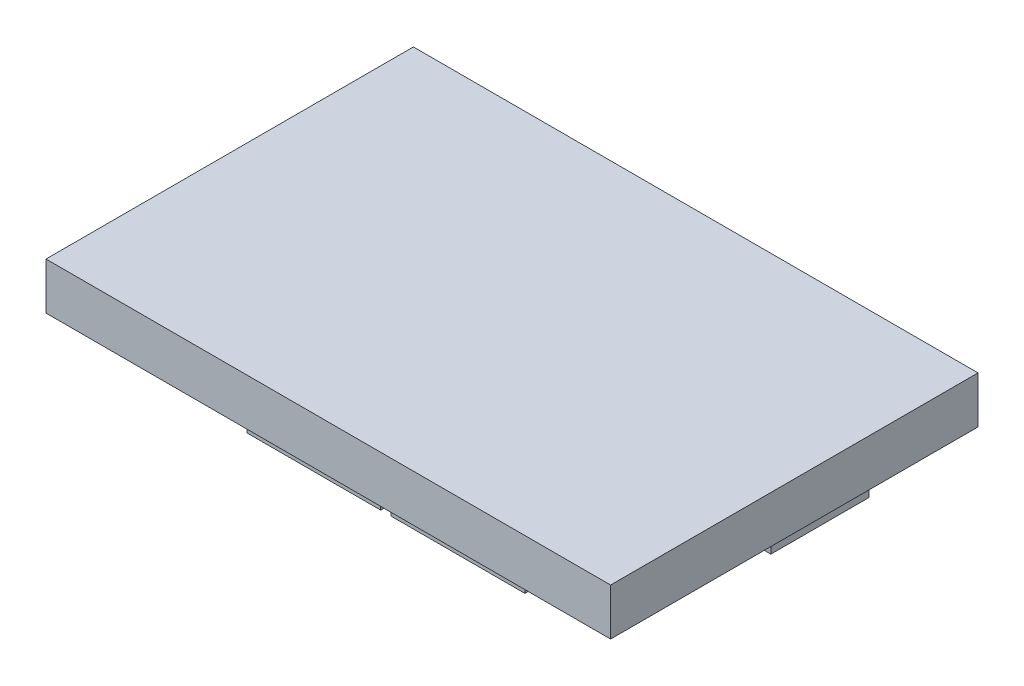
ISO-10303-21;
HEADER;
FILE_DESCRIPTION(('STEP AP214'),'2;1');
FILE_NAME('part.step','',(''),(''),'','','');
FILE_SCHEMA(('AUTOMOTIVE_DESIGN { 1 0 10303 214 1 1 1 1 }'));
ENDSEC;
DATA;
#1=APPLICATION_CONTEXT('core data for automotive mechanical design processes');
#2=APPLICATION_PROTOCOL_DEFINITION('international standard','automotive_design',2000,#1);
#3=PRODUCT_CONTEXT('',#1,'mechanical');
#4=PRODUCT('Part','Part','',(#3));
#5=PRODUCT_RELATED_PRODUCT_CATEGORY('part','',(#4));
#6=PRODUCT_DEFINITION_FORMATION('','',#4);
#7=PRODUCT_DEFINITION_CONTEXT('part definition',#1,'design');
#8=PRODUCT_DEFINITION('design','',#6,#7);
#9=PRODUCT_DEFINITION_SHAPE('','',#8);
#10=(LENGTH_UNIT() NAMED_UNIT(*) SI_UNIT(.MILLI.,.METRE.));
#11=(NAMED_UNIT(*) PLANE_ANGLE_UNIT() SI_UNIT($,.RADIAN.));
#12=(NAMED_UNIT(*) SI_UNIT($,.STERADIAN.) SOLID_ANGLE_UNIT());
#13=UNCERTAINTY_MEASURE_WITH_UNIT(LENGTH_MEASURE(1.E-05),#10,'distance_accuracy_value','');
#14=(GEOMETRIC_REPRESENTATION_CONTEXT(3) GLOBAL_UNCERTAINTY_ASSIGNED_CONTEXT((#13)) GLOBAL_UNIT_ASSIGNED_CONTEXT((#10,
#11,#12)) REPRESENTATION_CONTEXT('',''));
#15=CARTESIAN_POINT('',(0.,0.,0.));
#16=DIRECTION('',(0.,0.,1.));
#17=DIRECTION('',(1.,0.,0.));
#18=AXIS2_PLACEMENT_3D('',#15,#16,#17);
#19=CARTESIAN_POINT('',(0.,0.,0.));
#20=DIRECTION('',(0.,-1.,0.));
#21=DIRECTION('',(0.,0.,-1.));
#22=AXIS2_PLACEMENT_3D('',#19,#20,#21);
#23=PLANE('',#22);
#24=DIRECTION('',(0.,0.,1.));
#25=VECTOR('',#24,1.);
#26=CARTESIAN_POINT('',(0.,0.,0.));
#27=LINE('',#26,#25);
#28=CARTESIAN_POINT('',(0.,0.,-55.7));
#29=VERTEX_POINT('',#28);
#30=CARTESIAN_POINT('',(0.,0.,0.));
#31=VERTEX_POINT('',#30);
#32=EDGE_CURVE('E339',#29,#31,#27,.T.);
#33=ORIENTED_EDGE('',*,*,#32,.F.);
#34=DIRECTION('',(-1.,0.,0.));
#35=VECTOR('',#34,1.);
#36=CARTESIAN_POINT('',(0.,0.,-55.7));
#37=LINE('',#36,#35);
#38=CARTESIAN_POINT('',(85.6,0.,-55.7));
#39=VERTEX_POINT('',#38);
#40=EDGE_CURVE('E344',#39,#29,#37,.T.);
#41=ORIENTED_EDGE('',*,*,#40,.F.);
#42=DIRECTION('',(0.,0.,-1.));
#43=VECTOR('',#42,1.);
#44=CARTESIAN_POINT('',(85.6,0.,0.));
#45=LINE('',#44,#43);
#46=CARTESIAN_POINT('',(85.6,0.,0.));
#47=VERTEX_POINT('',#46);
#48=EDGE_CURVE('E355',#47,#39,#45,.T.);
#49=ORIENTED_EDGE('',*,*,#48,.F.);
#50=DIRECTION('',(1.,0.,0.));
#51=VECTOR('',#50,1.);
#52=CARTESIAN_POINT('',(0.,0.,0.));
#53=LINE('',#52,#51);
#54=EDGE_CURVE('E353',#31,#47,#53,.T.);
#55=ORIENTED_EDGE('',*,*,#54,.F.);
#56=EDGE_LOOP('',(#33,#41,#49,#55));
#57=FACE_BOUND('',#56,.T.);
#58=DIRECTION('',(1.,0.,0.));
#59=VECTOR('',#58,1.);
#60=CARTESIAN_POINT('',(28.45,0.,-4.5));
#61=LINE('',#60,#59);
#62=CARTESIAN_POINT('',(28.45,0.,-4.5));
#63=VERTEX_POINT('',#62);
#64=CARTESIAN_POINT('',(48.75,0.,-4.5));
#65=VERTEX_POINT('',#64);
#66=EDGE_CURVE('E324',#63,#65,#61,.T.);
#67=ORIENTED_EDGE('',*,*,#66,.F.);
#68=DIRECTION('',(0.,0.,-1.));
#69=VECTOR('',#68,1.);
#70=CARTESIAN_POINT('',(28.45,0.,-2.));
#71=LINE('',#70,#69);
#72=CARTESIAN_POINT('',(28.45,0.,-2.));
#73=VERTEX_POINT('',#72);
#74=EDGE_CURVE('E310',#73,#63,#71,.T.);
#75=ORIENTED_EDGE('',*,*,#74,.F.);
#76=DIRECTION('',(-1.,0.,0.));
#77=VECTOR('',#76,1.);
#78=CARTESIAN_POINT('',(28.45,0.,-2.));
#79=LINE('',#78,#77);
#80=CARTESIAN_POINT('',(48.75,0.,-2.));
#81=VERTEX_POINT('',#80);
#82=EDGE_CURVE('E315',#81,#73,#79,.T.);
#83=ORIENTED_EDGE('',*,*,#82,.F.);
#84=DIRECTION('',(0.,0.,1.));
#85=VECTOR('',#84,1.);
#86=CARTESIAN_POINT('',(48.75,0.,-2.));
#87=LINE('',#86,#85);
#88=EDGE_CURVE('E326',#65,#81,#87,.T.);
#89=ORIENTED_EDGE('',*,*,#88,.F.);
#90=EDGE_LOOP('',(#67,#75,#83,#89));
#91=FACE_BOUND('',#90,.T.);
#92=DIRECTION('',(1.,0.,0.));
#93=VECTOR('',#92,1.);
#94=CARTESIAN_POINT('',(50.3,0.,-4.5));
#95=LINE('',#94,#93);
#96=CARTESIAN_POINT('',(50.3,0.,-4.5));
#97=VERTEX_POINT('',#96);
#98=CARTESIAN_POINT('',(70.6,0.,-4.5));
#99=VERTEX_POINT('',#98);
#100=EDGE_CURVE('E295',#97,#99,#95,.T.);
#101=ORIENTED_EDGE('',*,*,#100,.F.);
#102=DIRECTION('',(0.,0.,-1.));
#103=VECTOR('',#102,1.);
#104=CARTESIAN_POINT('',(50.3,0.,-2.));
#105=LINE('',#104,#103);
#106=CARTESIAN_POINT('',(50.3,0.,-2.));
#107=VERTEX_POINT('',#106);
#108=EDGE_CURVE('E281',#107,#97,#105,.T.);
#109=ORIENTED_EDGE('',*,*,#108,.F.);
#110=DIRECTION('',(-1.,0.,0.));
#111=VECTOR('',#110,1.);
#112=CARTESIAN_POINT('',(50.3,0.,-2.));
#113=LINE('',#112,#111);
#114=CARTESIAN_POINT('',(70.6,0.,-2.));
#115=VERTEX_POINT('',#114);
#116=EDGE_CURVE('E286',#115,#107,#113,.T.);
#117=ORIENTED_EDGE('',*,*,#116,.F.);
#118=DIRECTION('',(0.,0.,1.));
#119=VECTOR('',#118,1.);
#120=CARTESIAN_POINT('',(70.6,0.,-2.));
#121=LINE('',#120,#119);
#122=EDGE_CURVE('E297',#99,#115,#121,.T.);
#123=ORIENTED_EDGE('',*,*,#122,.F.);
#124=EDGE_LOOP('',(#101,#109,#117,#123));
#125=FACE_BOUND('',#124,.T.);
#126=DIRECTION('',(-1.,0.,0.));
#127=VECTOR('',#126,1.);
#128=CARTESIAN_POINT('',(61.6,0.,-50.7));
#129=LINE('',#128,#127);
#130=CARTESIAN_POINT('',(61.6,0.,-50.7));
#131=VERTEX_POINT('',#130);
#132=CARTESIAN_POINT('',(46.3,0.,-50.7));
#133=VERTEX_POINT('',#132);
#134=EDGE_CURVE('E266',#131,#133,#129,.T.);
#135=ORIENTED_EDGE('',*,*,#134,.F.);
#136=DIRECTION('',(0.,0.,1.));
#137=VECTOR('',#136,1.);
#138=CARTESIAN_POINT('',(61.6,0.,-53.2));
#139=LINE('',#138,#137);
#140=CARTESIAN_POINT('',(61.6,0.,-53.2));
#141=VERTEX_POINT('',#140);
#142=EDGE_CURVE('E252',#141,#131,#139,.T.);
#143=ORIENTED_EDGE('',*,*,#142,.F.);
#144=DIRECTION('',(1.,0.,0.));
#145=VECTOR('',#144,1.);
#146=CARTESIAN_POINT('',(61.6,0.,-53.2));
#147=LINE('',#146,#145);
#148=CARTESIAN_POINT('',(46.3,0.,-53.2));
#149=VERTEX_POINT('',#148);
#150=EDGE_CURVE('E257',#149,#141,#147,.T.);
#151=ORIENTED_EDGE('',*,*,#150,.F.);
#152=DIRECTION('',(0.,0.,-1.));
#153=VECTOR('',#152,1.);
#154=CARTESIAN_POINT('',(46.3,0.,-53.2));
#155=LINE('',#154,#153);
#156=EDGE_CURVE('E268',#133,#149,#155,.T.);
#157=ORIENTED_EDGE('',*,*,#156,.F.);
#158=EDGE_LOOP('',(#135,#143,#151,#157));
#159=FACE_BOUND('',#158,.T.);
#160=DIRECTION('',(-1.,0.,0.));
#161=VECTOR('',#160,1.);
#162=CARTESIAN_POINT('',(43.75,0.,-50.7));
#163=LINE('',#162,#161);
#164=CARTESIAN_POINT('',(43.75,0.,-50.7));
#165=VERTEX_POINT('',#164);
#166=CARTESIAN_POINT('',(28.45,0.,-50.7));
#167=VERTEX_POINT('',#166);
#168=EDGE_CURVE('E224',#165,#167,#163,.T.);
#169=ORIENTED_EDGE('',*,*,#168,.F.);
#170=DIRECTION('',(0.,0.,1.));
#171=VECTOR('',#170,1.);
#172=CARTESIAN_POINT('',(43.75,0.,-53.2));
#173=LINE('',#172,#171);
#174=CARTESIAN_POINT('',(43.75,0.,-53.2));
#175=VERTEX_POINT('',#174);
#176=EDGE_CURVE('E221',#175,#165,#173,.T.);
#177=ORIENTED_EDGE('',*,*,#176,.F.);
#178=DIRECTION('',(1.,0.,0.));
#179=VECTOR('',#178,1.);
#180=CARTESIAN_POINT('',(43.75,0.,-53.2));
#181=LINE('',#180,#179);
#182=CARTESIAN_POINT('',(28.45,0.,-53.2));
#183=VERTEX_POINT('',#182);
#184=EDGE_CURVE('E233',#183,#175,#181,.T.);
#185=ORIENTED_EDGE('',*,*,#184,.F.);
#186=DIRECTION('',(0.,0.,-1.));
#187=VECTOR('',#186,1.);
#188=CARTESIAN_POINT('',(28.45,0.,-53.2));
#189=LINE('',#188,#187);
#190=EDGE_CURVE('E241',#167,#183,#189,.T.);
#191=ORIENTED_EDGE('',*,*,#190,.F.);
#192=EDGE_LOOP('',(#169,#177,#185,#191));
#193=FACE_BOUND('',#192,.T.);
#194=DIRECTION('',(-1.,0.,0.));
#195=VECTOR('',#194,1.);
#196=CARTESIAN_POINT('',(84.6,0.,-25.3));
#197=LINE('',#196,#195);
#198=CARTESIAN_POINT('',(84.6,0.,-25.3));
#199=VERTEX_POINT('',#198);
#200=CARTESIAN_POINT('',(69.6,0.,-25.3));
#201=VERTEX_POINT('',#200);
#202=EDGE_CURVE('E679',#199,#201,#197,.T.);
#203=ORIENTED_EDGE('',*,*,#202,.F.);
#204=DIRECTION('',(0.,0.,1.));
#205=VECTOR('',#204,1.);
#206=CARTESIAN_POINT('',(84.6,0.,-25.3));
#207=LINE('',#206,#205);
#208=CARTESIAN_POINT('',(84.6,0.,-40.2));
#209=VERTEX_POINT('',#208);
#210=EDGE_CURVE('E219',#209,#199,#207,.T.);
#211=ORIENTED_EDGE('',*,*,#210,.F.);
#212=DIRECTION('',(1.,0.,0.));
#213=VECTOR('',#212,1.);
#214=CARTESIAN_POINT('',(84.6,0.,-40.2));
#215=LINE('',#214,#213);
#216=CARTESIAN_POINT('',(69.6,0.,-40.2));
#217=VERTEX_POINT('',#216);
#218=EDGE_CURVE('E215',#217,#209,#215,.T.);
#219=ORIENTED_EDGE('',*,*,#218,.F.);
#220=DIRECTION('',(0.,0.,-1.));
#221=VECTOR('',#220,1.);
#222=CARTESIAN_POINT('',(69.6,0.,-25.3));
#223=LINE('',#222,#221);
#224=EDGE_CURVE('E676',#201,#217,#223,.T.);
#225=ORIENTED_EDGE('',*,*,#224,.F.);
#226=EDGE_LOOP('',(#203,#211,#219,#225));
#227=FACE_BOUND('',#226,.T.);
#228=ADVANCED_FACE('F34',(#57,#91,#125,#159,#193,#227),#23,.T.);
#229=CARTESIAN_POINT('',(0.,7.1,0.));
#230=DIRECTION('',(1.,0.,0.));
#231=DIRECTION('',(0.,0.,-1.));
#232=AXIS2_PLACEMENT_3D('',#229,#230,#231);
#233=PLANE('',#232);
#234=ORIENTED_EDGE('',*,*,#32,.T.);
#235=DIRECTION('',(0.,-1.,0.));
#236=VECTOR('',#235,1.);
#237=CARTESIAN_POINT('',(0.,7.1,0.));
#238=LINE('',#237,#236);
#239=CARTESIAN_POINT('',(0.,7.1,0.));
#240=VERTEX_POINT('',#239);
#241=EDGE_CURVE('E11',#240,#31,#238,.T.);
#242=ORIENTED_EDGE('',*,*,#241,.F.);
#243=DIRECTION('',(0.,0.,1.));
#244=VECTOR('',#243,1.);
#245=CARTESIAN_POINT('',(0.,7.1,0.));
#246=LINE('',#245,#244);
#247=CARTESIAN_POINT('',(0.,7.1,-55.7));
#248=VERTEX_POINT('',#247);
#249=EDGE_CURVE('E340',#248,#240,#246,.T.);
#250=ORIENTED_EDGE('',*,*,#249,.F.);
#251=DIRECTION('',(0.,-1.,0.));
#252=VECTOR('',#251,1.);
#253=CARTESIAN_POINT('',(0.,7.1,-55.7));
#254=LINE('',#253,#252);
#255=EDGE_CURVE('E350',#248,#29,#254,.T.);
#256=ORIENTED_EDGE('',*,*,#255,.T.);
#257=EDGE_LOOP('',(#234,#242,#250,#256));
#258=FACE_BOUND('',#257,.T.);
#259=ADVANCED_FACE('F36',(#258),#233,.F.);
#260=CARTESIAN_POINT('',(0.,7.1,0.));
#261=DIRECTION('',(0.,0.,-1.));
#262=DIRECTION('',(-1.,0.,0.));
#263=AXIS2_PLACEMENT_3D('',#260,#261,#262);
#264=PLANE('',#263);
#265=ORIENTED_EDGE('',*,*,#54,.T.);
#266=DIRECTION('',(0.,-1.,0.));
#267=VECTOR('',#266,1.);
#268=CARTESIAN_POINT('',(85.6,7.1,0.));
#269=LINE('',#268,#267);
#270=CARTESIAN_POINT('',(85.6,7.1,0.));
#271=VERTEX_POINT('',#270);
#272=EDGE_CURVE('E42',#271,#47,#269,.T.);
#273=ORIENTED_EDGE('',*,*,#272,.F.);
#274=DIRECTION('',(1.,0.,0.));
#275=VECTOR('',#274,1.);
#276=CARTESIAN_POINT('',(0.,7.1,0.));
#277=LINE('',#276,#275);
#278=EDGE_CURVE('E343',#240,#271,#277,.T.);
#279=ORIENTED_EDGE('',*,*,#278,.F.);
#280=ORIENTED_EDGE('',*,*,#241,.T.);
#281=EDGE_LOOP('',(#265,#273,#279,#280));
#282=FACE_BOUND('',#281,.T.);
#283=ADVANCED_FACE('F383',(#282),#264,.F.);
#284=CARTESIAN_POINT('',(85.6,7.1,0.));
#285=DIRECTION('',(-1.,0.,0.));
#286=DIRECTION('',(0.,0.,1.));
#287=AXIS2_PLACEMENT_3D('',#284,#285,#286);
#288=PLANE('',#287);
#289=ORIENTED_EDGE('',*,*,#48,.T.);
#290=DIRECTION('',(0.,-1.,0.));
#291=VECTOR('',#290,1.);
#292=CARTESIAN_POINT('',(85.6,7.1,-55.7));
#293=LINE('',#292,#291);
#294=CARTESIAN_POINT('',(85.6,7.1,-55.7));
#295=VERTEX_POINT('',#294);
#296=EDGE_CURVE('E360',#295,#39,#293,.T.);
#297=ORIENTED_EDGE('',*,*,#296,.F.);
#298=DIRECTION('',(0.,0.,-1.));
#299=VECTOR('',#298,1.);
#300=CARTESIAN_POINT('',(85.6,7.1,0.));
#301=LINE('',#300,#299);
#302=EDGE_CURVE('E346',#271,#295,#301,.T.);
#303=ORIENTED_EDGE('',*,*,#302,.F.);
#304=ORIENTED_EDGE('',*,*,#272,.T.);
#305=EDGE_LOOP('',(#289,#297,#303,#304));
#306=FACE_BOUND('',#305,.T.);
#307=ADVANCED_FACE('F367',(#306),#288,.F.);
#308=CARTESIAN_POINT('',(0.,7.1,-55.7));
#309=DIRECTION('',(0.,0.,1.));
#310=DIRECTION('',(1.,0.,0.));
#311=AXIS2_PLACEMENT_3D('',#308,#309,#310);
#312=PLANE('',#311);
#313=ORIENTED_EDGE('',*,*,#40,.T.);
#314=ORIENTED_EDGE('',*,*,#255,.F.);
#315=DIRECTION('',(-1.,0.,0.));
#316=VECTOR('',#315,1.);
#317=CARTESIAN_POINT('',(0.,7.1,-55.7));
#318=LINE('',#317,#316);
#319=EDGE_CURVE('E348',#295,#248,#318,.T.);
#320=ORIENTED_EDGE('',*,*,#319,.F.);
#321=ORIENTED_EDGE('',*,*,#296,.T.);
#322=EDGE_LOOP('',(#313,#314,#320,#321));
#323=FACE_BOUND('',#322,.T.);
#324=ADVANCED_FACE('F376',(#323),#312,.F.);
#325=CARTESIAN_POINT('',(0.,7.1,0.));
#326=DIRECTION('',(0.,-1.,0.));
#327=DIRECTION('',(0.,0.,-1.));
#328=AXIS2_PLACEMENT_3D('',#325,#326,#327);
#329=PLANE('',#328);
#330=ORIENTED_EDGE('',*,*,#249,.T.);
#331=ORIENTED_EDGE('',*,*,#278,.T.);
#332=ORIENTED_EDGE('',*,*,#302,.T.);
#333=ORIENTED_EDGE('',*,*,#319,.T.);
#334=EDGE_LOOP('',(#330,#331,#332,#333));
#335=FACE_BOUND('',#334,.T.);
#336=ADVANCED_FACE('F382',(#335),#329,.F.);
#337=CARTESIAN_POINT('',(28.45,-2.5,-2.));
#338=DIRECTION('',(1.,0.,0.));
#339=DIRECTION('',(0.,0.,-1.));
#340=AXIS2_PLACEMENT_3D('',#337,#338,#339);
#341=PLANE('',#340);
#342=ORIENTED_EDGE('',*,*,#74,.T.);
#343=DIRECTION('',(0.,1.,0.));
#344=VECTOR('',#343,1.);
#345=CARTESIAN_POINT('',(28.45,-2.5,-4.5));
#346=LINE('',#345,#344);
#347=CARTESIAN_POINT('',(28.45,-2.5,-4.5));
#348=VERTEX_POINT('',#347);
#349=EDGE_CURVE('E337',#348,#63,#346,.T.);
#350=ORIENTED_EDGE('',*,*,#349,.F.);
#351=DIRECTION('',(0.,0.,-1.));
#352=VECTOR('',#351,1.);
#353=CARTESIAN_POINT('',(28.45,-2.5,-2.));
#354=LINE('',#353,#352);
#355=CARTESIAN_POINT('',(28.45,-2.5,-2.));
#356=VERTEX_POINT('',#355);
#357=EDGE_CURVE('E311',#356,#348,#354,.T.);
#358=ORIENTED_EDGE('',*,*,#357,.F.);
#359=DIRECTION('',(0.,1.,0.));
#360=VECTOR('',#359,1.);
#361=CARTESIAN_POINT('',(28.45,-2.5,-2.));
#362=LINE('',#361,#360);
#363=EDGE_CURVE('E321',#356,#73,#362,.T.);
#364=ORIENTED_EDGE('',*,*,#363,.T.);
#365=EDGE_LOOP('',(#342,#350,#358,#364));
#366=FACE_BOUND('',#365,.T.);
#367=ADVANCED_FACE('F401',(#366),#341,.F.);
#368=CARTESIAN_POINT('',(28.45,-2.5,-4.5));
#369=DIRECTION('',(0.,0.,1.));
#370=DIRECTION('',(1.,0.,0.));
#371=AXIS2_PLACEMENT_3D('',#368,#369,#370);
#372=PLANE('',#371);
#373=ORIENTED_EDGE('',*,*,#66,.T.);
#374=DIRECTION('',(0.,1.,0.));
#375=VECTOR('',#374,1.);
#376=CARTESIAN_POINT('',(48.75,-2.5,-4.5));
#377=LINE('',#376,#375);
#378=CARTESIAN_POINT('',(48.75,-2.5,-4.5));
#379=VERTEX_POINT('',#378);
#380=EDGE_CURVE('E334',#379,#65,#377,.T.);
#381=ORIENTED_EDGE('',*,*,#380,.F.);
#382=DIRECTION('',(1.,0.,0.));
#383=VECTOR('',#382,1.);
#384=CARTESIAN_POINT('',(28.45,-2.5,-4.5));
#385=LINE('',#384,#383);
#386=EDGE_CURVE('E314',#348,#379,#385,.T.);
#387=ORIENTED_EDGE('',*,*,#386,.F.);
#388=ORIENTED_EDGE('',*,*,#349,.T.);
#389=EDGE_LOOP('',(#373,#381,#387,#388));
#390=FACE_BOUND('',#389,.T.);
#391=ADVANCED_FACE('F405',(#390),#372,.F.);
#392=CARTESIAN_POINT('',(48.75,-2.5,-2.));
#393=DIRECTION('',(-1.,0.,0.));
#394=DIRECTION('',(0.,0.,1.));
#395=AXIS2_PLACEMENT_3D('',#392,#393,#394);
#396=PLANE('',#395);
#397=ORIENTED_EDGE('',*,*,#88,.T.);
#398=DIRECTION('',(0.,1.,0.));
#399=VECTOR('',#398,1.);
#400=CARTESIAN_POINT('',(48.75,-2.5,-2.));
#401=LINE('',#400,#399);
#402=CARTESIAN_POINT('',(48.75,-2.5,-2.));
#403=VERTEX_POINT('',#402);
#404=EDGE_CURVE('E332',#403,#81,#401,.T.);
#405=ORIENTED_EDGE('',*,*,#404,.F.);
#406=DIRECTION('',(0.,0.,1.));
#407=VECTOR('',#406,1.);
#408=CARTESIAN_POINT('',(48.75,-2.5,-2.));
#409=LINE('',#408,#407);
#410=EDGE_CURVE('E317',#379,#403,#409,.T.);
#411=ORIENTED_EDGE('',*,*,#410,.F.);
#412=ORIENTED_EDGE('',*,*,#380,.T.);
#413=EDGE_LOOP('',(#397,#405,#411,#412));
#414=FACE_BOUND('',#413,.T.);
#415=ADVANCED_FACE('F410',(#414),#396,.F.);
#416=CARTESIAN_POINT('',(28.45,-2.5,-2.));
#417=DIRECTION('',(0.,0.,-1.));
#418=DIRECTION('',(-1.,0.,0.));
#419=AXIS2_PLACEMENT_3D('',#416,#417,#418);
#420=PLANE('',#419);
#421=ORIENTED_EDGE('',*,*,#82,.T.);
#422=ORIENTED_EDGE('',*,*,#363,.F.);
#423=DIRECTION('',(-1.,0.,0.));
#424=VECTOR('',#423,1.);
#425=CARTESIAN_POINT('',(28.45,-2.5,-2.));
#426=LINE('',#425,#424);
#427=EDGE_CURVE('E319',#403,#356,#426,.T.);
#428=ORIENTED_EDGE('',*,*,#427,.F.);
#429=ORIENTED_EDGE('',*,*,#404,.T.);
#430=EDGE_LOOP('',(#421,#422,#428,#429));
#431=FACE_BOUND('',#430,.T.);
#432=ADVANCED_FACE('F416',(#431),#420,.F.);
#433=CARTESIAN_POINT('',(0.,-2.5,0.));
#434=DIRECTION('',(0.,-1.,0.));
#435=DIRECTION('',(0.,0.,-1.));
#436=AXIS2_PLACEMENT_3D('',#433,#434,#435);
#437=PLANE('',#436);
#438=ORIENTED_EDGE('',*,*,#357,.T.);
#439=ORIENTED_EDGE('',*,*,#386,.T.);
#440=ORIENTED_EDGE('',*,*,#410,.T.);
#441=ORIENTED_EDGE('',*,*,#427,.T.);
#442=EDGE_LOOP('',(#438,#439,#440,#441));
#443=FACE_BOUND('',#442,.T.);
#444=ADVANCED_FACE('F420',(#443),#437,.T.);
#445=CARTESIAN_POINT('',(50.3,-2.5,-2.));
#446=DIRECTION('',(1.,0.,0.));
#447=DIRECTION('',(0.,0.,-1.));
#448=AXIS2_PLACEMENT_3D('',#445,#446,#447);
#449=PLANE('',#448);
#450=ORIENTED_EDGE('',*,*,#108,.T.);
#451=DIRECTION('',(0.,1.,0.));
#452=VECTOR('',#451,1.);
#453=CARTESIAN_POINT('',(50.3,-2.5,-4.5));
#454=LINE('',#453,#452);
#455=CARTESIAN_POINT('',(50.3,-2.5,-4.5));
#456=VERTEX_POINT('',#455);
#457=EDGE_CURVE('E308',#456,#97,#454,.T.);
#458=ORIENTED_EDGE('',*,*,#457,.F.);
#459=DIRECTION('',(0.,0.,-1.));
#460=VECTOR('',#459,1.);
#461=CARTESIAN_POINT('',(50.3,-2.5,-2.));
#462=LINE('',#461,#460);
#463=CARTESIAN_POINT('',(50.3,-2.5,-2.));
#464=VERTEX_POINT('',#463);
#465=EDGE_CURVE('E282',#464,#456,#462,.T.);
#466=ORIENTED_EDGE('',*,*,#465,.F.);
#467=DIRECTION('',(0.,1.,0.));
#468=VECTOR('',#467,1.);
#469=CARTESIAN_POINT('',(50.3,-2.5,-2.));
#470=LINE('',#469,#468);
#471=EDGE_CURVE('E292',#464,#107,#470,.T.);
#472=ORIENTED_EDGE('',*,*,#471,.T.);
#473=EDGE_LOOP('',(#450,#458,#466,#472));
#474=FACE_BOUND('',#473,.T.);
#475=ADVANCED_FACE('F424',(#474),#449,.F.);
#476=CARTESIAN_POINT('',(50.3,-2.5,-4.5));
#477=DIRECTION('',(0.,0.,1.));
#478=DIRECTION('',(1.,0.,0.));
#479=AXIS2_PLACEMENT_3D('',#476,#477,#478);
#480=PLANE('',#479);
#481=ORIENTED_EDGE('',*,*,#100,.T.);
#482=DIRECTION('',(0.,1.,0.));
#483=VECTOR('',#482,1.);
#484=CARTESIAN_POINT('',(70.6,-2.5,-4.5));
#485=LINE('',#484,#483);
#486=CARTESIAN_POINT('',(70.6,-2.5,-4.5));
#487=VERTEX_POINT('',#486);
#488=EDGE_CURVE('E305',#487,#99,#485,.T.);
#489=ORIENTED_EDGE('',*,*,#488,.F.);
#490=DIRECTION('',(1.,0.,0.));
#491=VECTOR('',#490,1.);
#492=CARTESIAN_POINT('',(50.3,-2.5,-4.5));
#493=LINE('',#492,#491);
#494=EDGE_CURVE('E285',#456,#487,#493,.T.);
#495=ORIENTED_EDGE('',*,*,#494,.F.);
#496=ORIENTED_EDGE('',*,*,#457,.T.);
#497=EDGE_LOOP('',(#481,#489,#495,#496));
#498=FACE_BOUND('',#497,.T.);
#499=ADVANCED_FACE('F428',(#498),#480,.F.);
#500=CARTESIAN_POINT('',(70.6,-2.5,-2.));
#501=DIRECTION('',(-1.,0.,0.));
#502=DIRECTION('',(0.,0.,1.));
#503=AXIS2_PLACEMENT_3D('',#500,#501,#502);
#504=PLANE('',#503);
#505=ORIENTED_EDGE('',*,*,#122,.T.);
#506=DIRECTION('',(0.,1.,0.));
#507=VECTOR('',#506,1.);
#508=CARTESIAN_POINT('',(70.6,-2.5,-2.));
#509=LINE('',#508,#507);
#510=CARTESIAN_POINT('',(70.6,-2.5,-2.));
#511=VERTEX_POINT('',#510);
#512=EDGE_CURVE('E303',#511,#115,#509,.T.);
#513=ORIENTED_EDGE('',*,*,#512,.F.);
#514=DIRECTION('',(0.,0.,1.));
#515=VECTOR('',#514,1.);
#516=CARTESIAN_POINT('',(70.6,-2.5,-2.));
#517=LINE('',#516,#515);
#518=EDGE_CURVE('E288',#487,#511,#517,.T.);
#519=ORIENTED_EDGE('',*,*,#518,.F.);
#520=ORIENTED_EDGE('',*,*,#488,.T.);
#521=EDGE_LOOP('',(#505,#513,#519,#520));
#522=FACE_BOUND('',#521,.T.);
#523=ADVANCED_FACE('F432',(#522),#504,.F.);
#524=CARTESIAN_POINT('',(50.3,-2.5,-2.));
#525=DIRECTION('',(0.,0.,-1.));
#526=DIRECTION('',(-1.,0.,0.));
#527=AXIS2_PLACEMENT_3D('',#524,#525,#526);
#528=PLANE('',#527);
#529=ORIENTED_EDGE('',*,*,#116,.T.);
#530=ORIENTED_EDGE('',*,*,#471,.F.);
#531=DIRECTION('',(-1.,0.,0.));
#532=VECTOR('',#531,1.);
#533=CARTESIAN_POINT('',(50.3,-2.5,-2.));
#534=LINE('',#533,#532);
#535=EDGE_CURVE('E290',#511,#464,#534,.T.);
#536=ORIENTED_EDGE('',*,*,#535,.F.);
#537=ORIENTED_EDGE('',*,*,#512,.T.);
#538=EDGE_LOOP('',(#529,#530,#536,#537));
#539=FACE_BOUND('',#538,.T.);
#540=ADVANCED_FACE('F436',(#539),#528,.F.);
#541=CARTESIAN_POINT('',(0.,-2.5,0.));
#542=DIRECTION('',(0.,-1.,0.));
#543=DIRECTION('',(0.,0.,-1.));
#544=AXIS2_PLACEMENT_3D('',#541,#542,#543);
#545=PLANE('',#544);
#546=ORIENTED_EDGE('',*,*,#465,.T.);
#547=ORIENTED_EDGE('',*,*,#494,.T.);
#548=ORIENTED_EDGE('',*,*,#518,.T.);
#549=ORIENTED_EDGE('',*,*,#535,.T.);
#550=EDGE_LOOP('',(#546,#547,#548,#549));
#551=FACE_BOUND('',#550,.T.);
#552=ADVANCED_FACE('F440',(#551),#545,.T.);
#553=CARTESIAN_POINT('',(61.6,-2.5,-53.2));
#554=DIRECTION('',(-1.,0.,0.));
#555=DIRECTION('',(0.,0.,1.));
#556=AXIS2_PLACEMENT_3D('',#553,#554,#555);
#557=PLANE('',#556);
#558=ORIENTED_EDGE('',*,*,#142,.T.);
#559=DIRECTION('',(0.,1.,0.));
#560=VECTOR('',#559,1.);
#561=CARTESIAN_POINT('',(61.6,-2.5,-50.7));
#562=LINE('',#561,#560);
#563=CARTESIAN_POINT('',(61.6,-2.5,-50.7));
#564=VERTEX_POINT('',#563);
#565=EDGE_CURVE('E279',#564,#131,#562,.T.);
#566=ORIENTED_EDGE('',*,*,#565,.F.);
#567=DIRECTION('',(0.,0.,1.));
#568=VECTOR('',#567,1.);
#569=CARTESIAN_POINT('',(61.6,-2.5,-53.2));
#570=LINE('',#569,#568);
#571=CARTESIAN_POINT('',(61.6,-2.5,-53.2));
#572=VERTEX_POINT('',#571);
#573=EDGE_CURVE('E253',#572,#564,#570,.T.);
#574=ORIENTED_EDGE('',*,*,#573,.F.);
#575=DIRECTION('',(0.,1.,0.));
#576=VECTOR('',#575,1.);
#577=CARTESIAN_POINT('',(61.6,-2.5,-53.2));
#578=LINE('',#577,#576);
#579=EDGE_CURVE('E263',#572,#141,#578,.T.);
#580=ORIENTED_EDGE('',*,*,#579,.T.);
#581=EDGE_LOOP('',(#558,#566,#574,#580));
#582=FACE_BOUND('',#581,.T.);
#583=ADVANCED_FACE('F444',(#582),#557,.F.);
#584=CARTESIAN_POINT('',(61.6,-2.5,-50.7));
#585=DIRECTION('',(0.,0.,-1.));
#586=DIRECTION('',(-1.,0.,0.));
#587=AXIS2_PLACEMENT_3D('',#584,#585,#586);
#588=PLANE('',#587);
#589=ORIENTED_EDGE('',*,*,#134,.T.);
#590=DIRECTION('',(0.,1.,0.));
#591=VECTOR('',#590,1.);
#592=CARTESIAN_POINT('',(46.3,-2.5,-50.7));
#593=LINE('',#592,#591);
#594=CARTESIAN_POINT('',(46.3,-2.5,-50.7));
#595=VERTEX_POINT('',#594);
#596=EDGE_CURVE('E276',#595,#133,#593,.T.);
#597=ORIENTED_EDGE('',*,*,#596,.F.);
#598=DIRECTION('',(-1.,0.,0.));
#599=VECTOR('',#598,1.);
#600=CARTESIAN_POINT('',(61.6,-2.5,-50.7));
#601=LINE('',#600,#599);
#602=EDGE_CURVE('E256',#564,#595,#601,.T.);
#603=ORIENTED_EDGE('',*,*,#602,.F.);
#604=ORIENTED_EDGE('',*,*,#565,.T.);
#605=EDGE_LOOP('',(#589,#597,#603,#604));
#606=FACE_BOUND('',#605,.T.);
#607=ADVANCED_FACE('F448',(#606),#588,.F.);
#608=CARTESIAN_POINT('',(46.3,-2.5,-53.2));
#609=DIRECTION('',(1.,0.,0.));
#610=DIRECTION('',(0.,0.,-1.));
#611=AXIS2_PLACEMENT_3D('',#608,#609,#610);
#612=PLANE('',#611);
#613=ORIENTED_EDGE('',*,*,#156,.T.);
#614=DIRECTION('',(0.,1.,0.));
#615=VECTOR('',#614,1.);
#616=CARTESIAN_POINT('',(46.3,-2.5,-53.2));
#617=LINE('',#616,#615);
#618=CARTESIAN_POINT('',(46.3,-2.5,-53.2));
#619=VERTEX_POINT('',#618);
#620=EDGE_CURVE('E274',#619,#149,#617,.T.);
#621=ORIENTED_EDGE('',*,*,#620,.F.);
#622=DIRECTION('',(0.,0.,-1.));
#623=VECTOR('',#622,1.);
#624=CARTESIAN_POINT('',(46.3,-2.5,-53.2));
#625=LINE('',#624,#623);
#626=EDGE_CURVE('E259',#595,#619,#625,.T.);
#627=ORIENTED_EDGE('',*,*,#626,.F.);
#628=ORIENTED_EDGE('',*,*,#596,.T.);
#629=EDGE_LOOP('',(#613,#621,#627,#628));
#630=FACE_BOUND('',#629,.T.);
#631=ADVANCED_FACE('F452',(#630),#612,.F.);
#632=CARTESIAN_POINT('',(61.6,-2.5,-53.2));
#633=DIRECTION('',(0.,0.,1.));
#634=DIRECTION('',(1.,0.,0.));
#635=AXIS2_PLACEMENT_3D('',#632,#633,#634);
#636=PLANE('',#635);
#637=ORIENTED_EDGE('',*,*,#150,.T.);
#638=ORIENTED_EDGE('',*,*,#579,.F.);
#639=DIRECTION('',(1.,0.,0.));
#640=VECTOR('',#639,1.);
#641=CARTESIAN_POINT('',(61.6,-2.5,-53.2));
#642=LINE('',#641,#640);
#643=EDGE_CURVE('E261',#619,#572,#642,.T.);
#644=ORIENTED_EDGE('',*,*,#643,.F.);
#645=ORIENTED_EDGE('',*,*,#620,.T.);
#646=EDGE_LOOP('',(#637,#638,#644,#645));
#647=FACE_BOUND('',#646,.T.);
#648=ADVANCED_FACE('F456',(#647),#636,.F.);
#649=CARTESIAN_POINT('',(0.,-2.5,0.));
#650=DIRECTION('',(0.,-1.,0.));
#651=DIRECTION('',(0.,0.,-1.));
#652=AXIS2_PLACEMENT_3D('',#649,#650,#651);
#653=PLANE('',#652);
#654=ORIENTED_EDGE('',*,*,#573,.T.);
#655=ORIENTED_EDGE('',*,*,#602,.T.);
#656=ORIENTED_EDGE('',*,*,#626,.T.);
#657=ORIENTED_EDGE('',*,*,#643,.T.);
#658=EDGE_LOOP('',(#654,#655,#656,#657));
#659=FACE_BOUND('',#658,.T.);
#660=ADVANCED_FACE('F460',(#659),#653,.T.);
#661=CARTESIAN_POINT('',(43.75,-2.5,-53.2));
#662=DIRECTION('',(-1.,0.,0.));
#663=DIRECTION('',(0.,0.,1.));
#664=AXIS2_PLACEMENT_3D('',#661,#662,#663);
#665=PLANE('',#664);
#666=ORIENTED_EDGE('',*,*,#176,.T.);
#667=DIRECTION('',(0.,1.,0.));
#668=VECTOR('',#667,1.);
#669=CARTESIAN_POINT('',(43.75,-2.5,-50.7));
#670=LINE('',#669,#668);
#671=CARTESIAN_POINT('',(43.75,-2.5,-50.7));
#672=VERTEX_POINT('',#671);
#673=EDGE_CURVE('E250',#672,#165,#670,.T.);
#674=ORIENTED_EDGE('',*,*,#673,.F.);
#675=DIRECTION('',(0.,0.,1.));
#676=VECTOR('',#675,1.);
#677=CARTESIAN_POINT('',(43.75,-2.5,-53.2));
#678=LINE('',#677,#676);
#679=CARTESIAN_POINT('',(43.75,-2.5,-53.2));
#680=VERTEX_POINT('',#679);
#681=EDGE_CURVE('E229',#680,#672,#678,.T.);
#682=ORIENTED_EDGE('',*,*,#681,.F.);
#683=DIRECTION('',(0.,1.,0.));
#684=VECTOR('',#683,1.);
#685=CARTESIAN_POINT('',(43.75,-2.5,-53.2));
#686=LINE('',#685,#684);
#687=EDGE_CURVE('E238',#680,#175,#686,.T.);
#688=ORIENTED_EDGE('',*,*,#687,.T.);
#689=EDGE_LOOP('',(#666,#674,#682,#688));
#690=FACE_BOUND('',#689,.T.);
#691=ADVANCED_FACE('F464',(#690),#665,.F.);
#692=CARTESIAN_POINT('',(43.75,-2.5,-50.7));
#693=DIRECTION('',(0.,0.,-1.));
#694=DIRECTION('',(-1.,0.,0.));
#695=AXIS2_PLACEMENT_3D('',#692,#693,#694);
#696=PLANE('',#695);
#697=ORIENTED_EDGE('',*,*,#168,.T.);
#698=DIRECTION('',(0.,1.,0.));
#699=VECTOR('',#698,1.);
#700=CARTESIAN_POINT('',(28.45,-2.5,-50.7));
#701=LINE('',#700,#699);
#702=CARTESIAN_POINT('',(28.45,-2.5,-50.7));
#703=VERTEX_POINT('',#702);
#704=EDGE_CURVE('E247',#703,#167,#701,.T.);
#705=ORIENTED_EDGE('',*,*,#704,.F.);
#706=DIRECTION('',(-1.,0.,0.));
#707=VECTOR('',#706,1.);
#708=CARTESIAN_POINT('',(43.75,-2.5,-50.7));
#709=LINE('',#708,#707);
#710=EDGE_CURVE('E232',#672,#703,#709,.T.);
#711=ORIENTED_EDGE('',*,*,#710,.F.);
#712=ORIENTED_EDGE('',*,*,#673,.T.);
#713=EDGE_LOOP('',(#697,#705,#711,#712));
#714=FACE_BOUND('',#713,.T.);
#715=ADVANCED_FACE('F468',(#714),#696,.F.);
#716=CARTESIAN_POINT('',(28.45,-2.5,-53.2));
#717=DIRECTION('',(1.,0.,0.));
#718=DIRECTION('',(0.,0.,-1.));
#719=AXIS2_PLACEMENT_3D('',#716,#717,#718);
#720=PLANE('',#719);
#721=ORIENTED_EDGE('',*,*,#190,.T.);
#722=DIRECTION('',(0.,1.,0.));
#723=VECTOR('',#722,1.);
#724=CARTESIAN_POINT('',(28.45,-2.5,-53.2));
#725=LINE('',#724,#723);
#726=CARTESIAN_POINT('',(28.45,-2.5,-53.2));
#727=VERTEX_POINT('',#726);
#728=EDGE_CURVE('E57',#727,#183,#725,.T.);
#729=ORIENTED_EDGE('',*,*,#728,.F.);
#730=DIRECTION('',(0.,0.,-1.));
#731=VECTOR('',#730,1.);
#732=CARTESIAN_POINT('',(28.45,-2.5,-53.2));
#733=LINE('',#732,#731);
#734=EDGE_CURVE('E235',#703,#727,#733,.T.);
#735=ORIENTED_EDGE('',*,*,#734,.F.);
#736=ORIENTED_EDGE('',*,*,#704,.T.);
#737=EDGE_LOOP('',(#721,#729,#735,#736));
#738=FACE_BOUND('',#737,.T.);
#739=ADVANCED_FACE('F472',(#738),#720,.F.);
#740=CARTESIAN_POINT('',(43.75,-2.5,-53.2));
#741=DIRECTION('',(0.,0.,1.));
#742=DIRECTION('',(1.,0.,0.));
#743=AXIS2_PLACEMENT_3D('',#740,#741,#742);
#744=PLANE('',#743);
#745=ORIENTED_EDGE('',*,*,#184,.T.);
#746=ORIENTED_EDGE('',*,*,#687,.F.);
#747=DIRECTION('',(1.,0.,0.));
#748=VECTOR('',#747,1.);
#749=CARTESIAN_POINT('',(43.75,-2.5,-53.2));
#750=LINE('',#749,#748);
#751=EDGE_CURVE('E237',#727,#680,#750,.T.);
#752=ORIENTED_EDGE('',*,*,#751,.F.);
#753=ORIENTED_EDGE('',*,*,#728,.T.);
#754=EDGE_LOOP('',(#745,#746,#752,#753));
#755=FACE_BOUND('',#754,.T.);
#756=ADVANCED_FACE('F476',(#755),#744,.F.);
#757=CARTESIAN_POINT('',(0.,-2.5,0.));
#758=DIRECTION('',(0.,-1.,0.));
#759=DIRECTION('',(0.,0.,-1.));
#760=AXIS2_PLACEMENT_3D('',#757,#758,#759);
#761=PLANE('',#760);
#762=ORIENTED_EDGE('',*,*,#681,.T.);
#763=ORIENTED_EDGE('',*,*,#710,.T.);
#764=ORIENTED_EDGE('',*,*,#734,.T.);
#765=ORIENTED_EDGE('',*,*,#751,.T.);
#766=EDGE_LOOP('',(#762,#763,#764,#765));
#767=FACE_BOUND('',#766,.T.);
#768=ADVANCED_FACE('F480',(#767),#761,.T.);
#769=CARTESIAN_POINT('',(84.6,-2.,-25.3));
#770=DIRECTION('',(-1.,0.,0.));
#771=DIRECTION('',(0.,0.,1.));
#772=AXIS2_PLACEMENT_3D('',#769,#770,#771);
#773=PLANE('',#772);
#774=ORIENTED_EDGE('',*,*,#210,.T.);
#775=DIRECTION('',(0.,1.,0.));
#776=VECTOR('',#775,1.);
#777=CARTESIAN_POINT('',(84.6,-2.,-25.3));
#778=LINE('',#777,#776);
#779=CARTESIAN_POINT('',(84.6,-2.,-25.3));
#780=VERTEX_POINT('',#779);
#781=EDGE_CURVE('E200',#780,#199,#778,.T.);
#782=ORIENTED_EDGE('',*,*,#781,.F.);
#783=DIRECTION('',(0.,0.,1.));
#784=VECTOR('',#783,1.);
#785=CARTESIAN_POINT('',(84.6,-2.,-25.3));
#786=LINE('',#785,#784);
#787=CARTESIAN_POINT('',(84.6,-2.,-40.2));
#788=VERTEX_POINT('',#787);
#789=EDGE_CURVE('E207',#788,#780,#786,.T.);
#790=ORIENTED_EDGE('',*,*,#789,.F.);
#791=DIRECTION('',(0.,1.,0.));
#792=VECTOR('',#791,1.);
#793=CARTESIAN_POINT('',(84.6,-2.,-40.2));
#794=LINE('',#793,#792);
#795=EDGE_CURVE('E673',#788,#209,#794,.T.);
#796=ORIENTED_EDGE('',*,*,#795,.T.);
#797=EDGE_LOOP('',(#774,#782,#790,#796));
#798=FACE_BOUND('',#797,.T.);
#799=ADVANCED_FACE('F217',(#798),#773,.F.);
#800=CARTESIAN_POINT('',(84.6,-2.,-25.3));
#801=DIRECTION('',(0.,0.,-1.));
#802=DIRECTION('',(-1.,0.,0.));
#803=AXIS2_PLACEMENT_3D('',#800,#801,#802);
#804=PLANE('',#803);
#805=ORIENTED_EDGE('',*,*,#202,.T.);
#806=DIRECTION('',(0.,1.,0.));
#807=VECTOR('',#806,1.);
#808=CARTESIAN_POINT('',(69.6,-2.,-25.3));
#809=LINE('',#808,#807);
#810=CARTESIAN_POINT('',(69.6,-2.,-25.3));
#811=VERTEX_POINT('',#810);
#812=EDGE_CURVE('E203',#811,#201,#809,.T.);
#813=ORIENTED_EDGE('',*,*,#812,.F.);
#814=DIRECTION('',(-1.,0.,0.));
#815=VECTOR('',#814,1.);
#816=CARTESIAN_POINT('',(84.6,-2.,-25.3));
#817=LINE('',#816,#815);
#818=EDGE_CURVE('E196',#780,#811,#817,.T.);
#819=ORIENTED_EDGE('',*,*,#818,.F.);
#820=ORIENTED_EDGE('',*,*,#781,.T.);
#821=EDGE_LOOP('',(#805,#813,#819,#820));
#822=FACE_BOUND('',#821,.T.);
#823=ADVANCED_FACE('F198',(#822),#804,.F.);
#824=CARTESIAN_POINT('',(69.6,-2.,-25.3));
#825=DIRECTION('',(1.,0.,0.));
#826=DIRECTION('',(0.,0.,-1.));
#827=AXIS2_PLACEMENT_3D('',#824,#825,#826);
#828=PLANE('',#827);
#829=ORIENTED_EDGE('',*,*,#224,.T.);
#830=DIRECTION('',(0.,1.,0.));
#831=VECTOR('',#830,1.);
#832=CARTESIAN_POINT('',(69.6,-2.,-40.2));
#833=LINE('',#832,#831);
#834=CARTESIAN_POINT('',(69.6,-2.,-40.2));
#835=VERTEX_POINT('',#834);
#836=EDGE_CURVE('E49',#835,#217,#833,.T.);
#837=ORIENTED_EDGE('',*,*,#836,.F.);
#838=DIRECTION('',(0.,0.,-1.));
#839=VECTOR('',#838,1.);
#840=CARTESIAN_POINT('',(69.6,-2.,-25.3));
#841=LINE('',#840,#839);
#842=EDGE_CURVE('E206',#811,#835,#841,.T.);
#843=ORIENTED_EDGE('',*,*,#842,.F.);
#844=ORIENTED_EDGE('',*,*,#812,.T.);
#845=EDGE_LOOP('',(#829,#837,#843,#844));
#846=FACE_BOUND('',#845,.T.);
#847=ADVANCED_FACE('F488',(#846),#828,.F.);
#848=CARTESIAN_POINT('',(84.6,-2.,-40.2));
#849=DIRECTION('',(0.,0.,1.));
#850=DIRECTION('',(1.,0.,0.));
#851=AXIS2_PLACEMENT_3D('',#848,#849,#850);
#852=PLANE('',#851);
#853=ORIENTED_EDGE('',*,*,#218,.T.);
#854=ORIENTED_EDGE('',*,*,#795,.F.);
#855=DIRECTION('',(1.,0.,0.));
#856=VECTOR('',#855,1.);
#857=CARTESIAN_POINT('',(84.6,-2.,-40.2));
#858=LINE('',#857,#856);
#859=EDGE_CURVE('E211',#835,#788,#858,.T.);
#860=ORIENTED_EDGE('',*,*,#859,.F.);
#861=ORIENTED_EDGE('',*,*,#836,.T.);
#862=EDGE_LOOP('',(#853,#854,#860,#861));
#863=FACE_BOUND('',#862,.T.);
#864=ADVANCED_FACE('F491',(#863),#852,.F.);
#865=CARTESIAN_POINT('',(0.,-2.,0.));
#866=DIRECTION('',(0.,1.,0.));
#867=DIRECTION('',(0.,0.,1.));
#868=AXIS2_PLACEMENT_3D('',#865,#866,#867);
#869=PLANE('',#868);
#870=ORIENTED_EDGE('',*,*,#789,.T.);
#871=ORIENTED_EDGE('',*,*,#818,.T.);
#872=ORIENTED_EDGE('',*,*,#842,.T.);
#873=ORIENTED_EDGE('',*,*,#859,.T.);
#874=EDGE_LOOP('',(#870,#871,#872,#873));
#875=FACE_BOUND('',#874,.T.);
#876=ADVANCED_FACE('F210',(#875),#869,.F.);
#877=CLOSED_SHELL('',(#228,#259,#283,#307,#324,#336,#367,#391,#415,#432,#444,#475,#499,#523,
#540,#552,#583,#607,#631,#648,#660,#691,#715,#739,#756,#768,#799,#823,#847,#864,#876));
#878=MANIFOLD_SOLID_BREP('B2',#877);
#879=ADVANCED_BREP_SHAPE_REPRESENTATION('',(#18,#878),#14);
#880=SHAPE_DEFINITION_REPRESENTATION(#9,#879);
ENDSEC;
END-ISO-10303-21;
